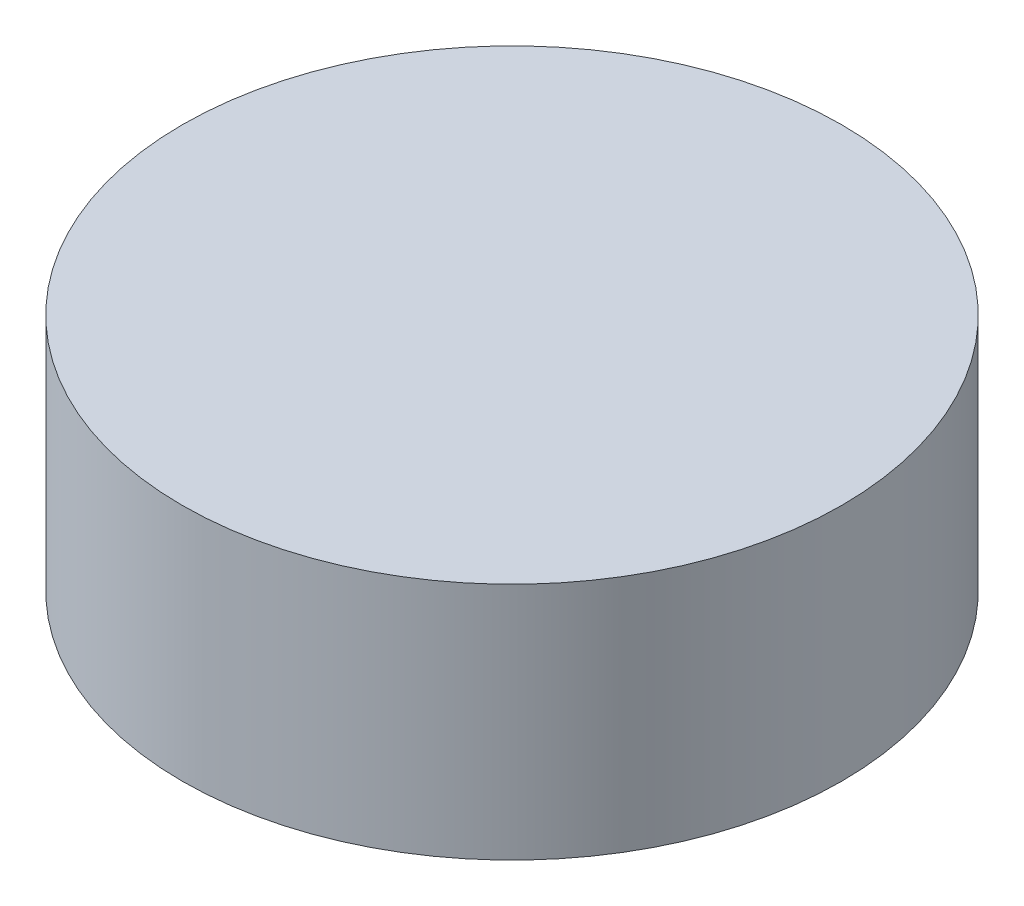
ISO-10303-21;
HEADER;
FILE_DESCRIPTION(('STEP AP214'),'2;1');
FILE_NAME('part.step','',(''),(''),'','','');
FILE_SCHEMA(('AUTOMOTIVE_DESIGN { 1 0 10303 214 1 1 1 1 }'));
ENDSEC;
DATA;
#1=APPLICATION_CONTEXT('core data for automotive mechanical design processes');
#2=APPLICATION_PROTOCOL_DEFINITION('international standard','automotive_design',2000,#1);
#3=PRODUCT_CONTEXT('',#1,'mechanical');
#4=PRODUCT('Part','Part','',(#3));
#5=PRODUCT_RELATED_PRODUCT_CATEGORY('part','',(#4));
#6=PRODUCT_DEFINITION_FORMATION('','',#4);
#7=PRODUCT_DEFINITION_CONTEXT('part definition',#1,'design');
#8=PRODUCT_DEFINITION('design','',#6,#7);
#9=PRODUCT_DEFINITION_SHAPE('','',#8);
#10=(LENGTH_UNIT() NAMED_UNIT(*) SI_UNIT(.MILLI.,.METRE.));
#11=(NAMED_UNIT(*) PLANE_ANGLE_UNIT() SI_UNIT($,.RADIAN.));
#12=(NAMED_UNIT(*) SI_UNIT($,.STERADIAN.) SOLID_ANGLE_UNIT());
#13=UNCERTAINTY_MEASURE_WITH_UNIT(LENGTH_MEASURE(1.E-05),#10,'distance_accuracy_value','');
#14=(GEOMETRIC_REPRESENTATION_CONTEXT(3) GLOBAL_UNCERTAINTY_ASSIGNED_CONTEXT((#13)) GLOBAL_UNIT_ASSIGNED_CONTEXT((#10,
#11,#12)) REPRESENTATION_CONTEXT('',''));
#15=CARTESIAN_POINT('',(0.,0.,0.));
#16=DIRECTION('',(0.,0.,1.));
#17=DIRECTION('',(1.,0.,0.));
#18=AXIS2_PLACEMENT_3D('',#15,#16,#17);
#19=CARTESIAN_POINT('',(0.,10.,0.));
#20=DIRECTION('',(0.,-1.,0.));
#21=DIRECTION('',(0.,0.,-1.));
#22=AXIS2_PLACEMENT_3D('',#19,#20,#21);
#23=CYLINDRICAL_SURFACE('',#22,13.8);
#24=CARTESIAN_POINT('',(0.,10.,0.));
#25=DIRECTION('',(0.,1.,0.));
#26=DIRECTION('',(0.,0.,1.));
#27=AXIS2_PLACEMENT_3D('',#24,#25,#26);
#28=CIRCLE('',#27,13.8);
#29=CARTESIAN_POINT('',(0.,10.,13.8));
#30=VERTEX_POINT('',#29);
#31=EDGE_CURVE('E10',#30,#30,#28,.T.);
#32=ORIENTED_EDGE('',*,*,#31,.F.);
#33=EDGE_LOOP('',(#32));
#34=FACE_BOUND('',#33,.T.);
#35=CARTESIAN_POINT('',(0.,0.,0.));
#36=DIRECTION('',(0.,1.,0.));
#37=DIRECTION('',(0.,0.,1.));
#38=AXIS2_PLACEMENT_3D('',#35,#36,#37);
#39=CIRCLE('',#38,13.8);
#40=CARTESIAN_POINT('',(0.,0.,13.8));
#41=VERTEX_POINT('',#40);
#42=EDGE_CURVE('E37',#41,#41,#39,.T.);
#43=ORIENTED_EDGE('',*,*,#42,.T.);
#44=EDGE_LOOP('',(#43));
#45=FACE_BOUND('',#44,.T.);
#46=ADVANCED_FACE('F34',(#34,#45),#23,.T.);
#47=CARTESIAN_POINT('',(0.,10.,0.));
#48=DIRECTION('',(0.,1.,0.));
#49=DIRECTION('',(0.,0.,1.));
#50=AXIS2_PLACEMENT_3D('',#47,#48,#49);
#51=PLANE('',#50);
#52=ORIENTED_EDGE('',*,*,#31,.T.);
#53=EDGE_LOOP('',(#52));
#54=FACE_BOUND('',#53,.T.);
#55=ADVANCED_FACE('F49',(#54),#51,.T.);
#56=CARTESIAN_POINT('',(0.,0.,0.));
#57=DIRECTION('',(0.,1.,0.));
#58=DIRECTION('',(0.,0.,1.));
#59=AXIS2_PLACEMENT_3D('',#56,#57,#58);
#60=PLANE('',#59);
#61=ORIENTED_EDGE('',*,*,#42,.F.);
#62=EDGE_LOOP('',(#61));
#63=FACE_BOUND('',#62,.T.);
#64=ADVANCED_FACE('F47',(#63),#60,.F.);
#65=CLOSED_SHELL('',(#46,#55,#64));
#66=MANIFOLD_SOLID_BREP('B2',#65);
#67=ADVANCED_BREP_SHAPE_REPRESENTATION('',(#18,#66),#14);
#68=SHAPE_DEFINITION_REPRESENTATION(#9,#67);
ENDSEC;
END-ISO-10303-21;
